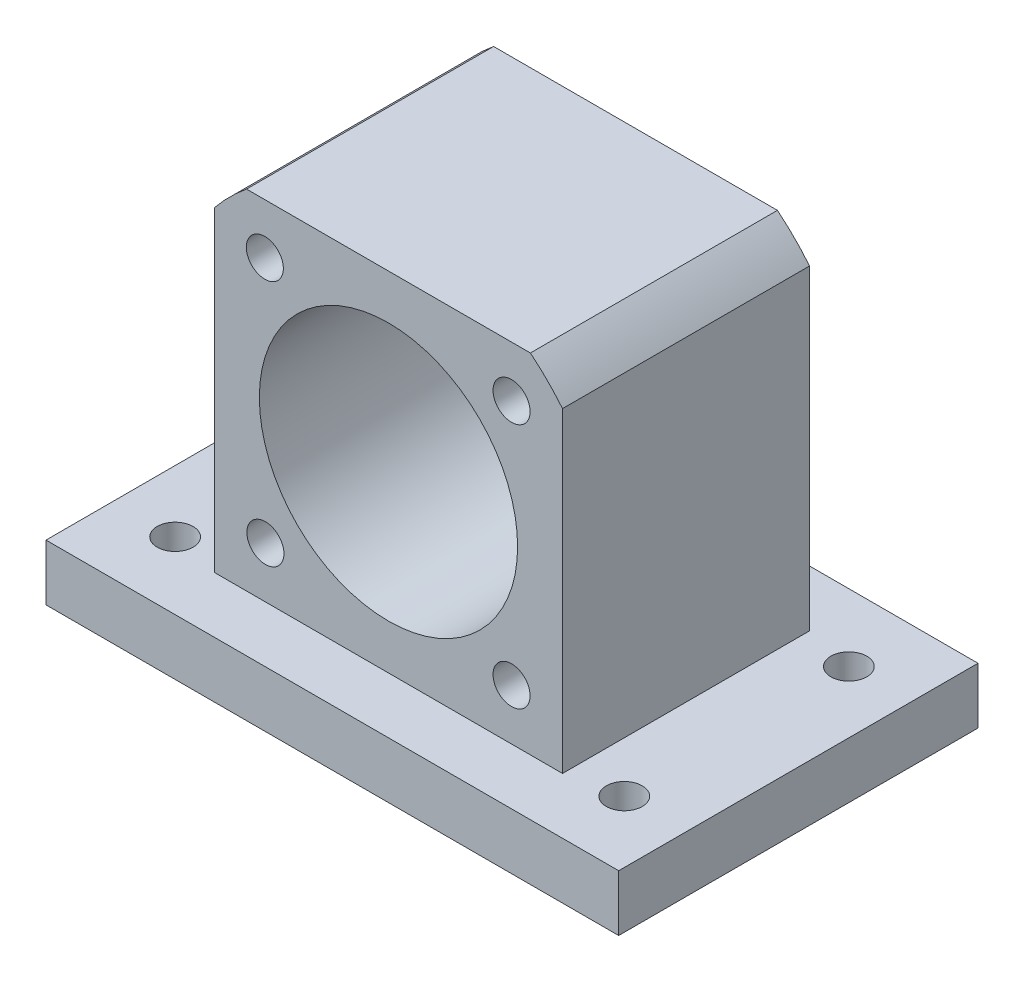
ISO-10303-21;
HEADER;
FILE_DESCRIPTION(('STEP AP214'),'2;1');
FILE_NAME('part.step','',(''),(''),'','','');
FILE_SCHEMA(('AUTOMOTIVE_DESIGN { 1 0 10303 214 1 1 1 1 }'));
ENDSEC;
DATA;
#1=APPLICATION_CONTEXT('core data for automotive mechanical design processes');
#2=APPLICATION_PROTOCOL_DEFINITION('international standard','automotive_design',2000,#1);
#3=PRODUCT_CONTEXT('',#1,'mechanical');
#4=PRODUCT('Part','Part','',(#3));
#5=PRODUCT_RELATED_PRODUCT_CATEGORY('part','',(#4));
#6=PRODUCT_DEFINITION_FORMATION('','',#4);
#7=PRODUCT_DEFINITION_CONTEXT('part definition',#1,'design');
#8=PRODUCT_DEFINITION('design','',#6,#7);
#9=PRODUCT_DEFINITION_SHAPE('','',#8);
#10=(LENGTH_UNIT() NAMED_UNIT(*) SI_UNIT(.MILLI.,.METRE.));
#11=(NAMED_UNIT(*) PLANE_ANGLE_UNIT() SI_UNIT($,.RADIAN.));
#12=(NAMED_UNIT(*) SI_UNIT($,.STERADIAN.) SOLID_ANGLE_UNIT());
#13=UNCERTAINTY_MEASURE_WITH_UNIT(LENGTH_MEASURE(1.E-05),#10,'distance_accuracy_value','');
#14=(GEOMETRIC_REPRESENTATION_CONTEXT(3) GLOBAL_UNCERTAINTY_ASSIGNED_CONTEXT((#13)) GLOBAL_UNIT_ASSIGNED_CONTEXT((#10,
#11,#12)) REPRESENTATION_CONTEXT('',''));
#15=CARTESIAN_POINT('',(0.,0.,0.));
#16=DIRECTION('',(0.,0.,1.));
#17=DIRECTION('',(1.,0.,0.));
#18=AXIS2_PLACEMENT_3D('',#15,#16,#17);
#19=CARTESIAN_POINT('',(15.5,-15.5,11.));
#20=DIRECTION('',(-1.,0.,0.));
#21=DIRECTION('',(0.,0.,1.));
#22=AXIS2_PLACEMENT_3D('',#19,#20,#21);
#23=PLANE('',#22);
#24=DIRECTION('',(0.,1.,0.));
#25=VECTOR('',#24,1.);
#26=CARTESIAN_POINT('',(15.5,-15.5,-11.));
#27=LINE('',#26,#25);
#28=CARTESIAN_POINT('',(15.5,-15.5,-11.));
#29=VERTEX_POINT('',#28);
#30=CARTESIAN_POINT('',(15.5,12.6392246597645,-11.));
#31=VERTEX_POINT('',#30);
#32=EDGE_CURVE('E118',#29,#31,#27,.T.);
#33=ORIENTED_EDGE('',*,*,#32,.T.);
#34=DIRECTION('',(0.,0.,-1.));
#35=VECTOR('',#34,1.);
#36=CARTESIAN_POINT('',(15.5,12.6392246597645,11.));
#37=LINE('',#36,#35);
#38=CARTESIAN_POINT('',(15.5,12.6392246597645,11.));
#39=VERTEX_POINT('',#38);
#40=EDGE_CURVE('E11',#39,#31,#37,.T.);
#41=ORIENTED_EDGE('',*,*,#40,.F.);
#42=DIRECTION('',(0.,1.,0.));
#43=VECTOR('',#42,1.);
#44=CARTESIAN_POINT('',(15.5,-15.5,11.));
#45=LINE('',#44,#43);
#46=CARTESIAN_POINT('',(15.5,-15.5,11.));
#47=VERTEX_POINT('',#46);
#48=EDGE_CURVE('E131',#47,#39,#45,.T.);
#49=ORIENTED_EDGE('',*,*,#48,.F.);
#50=DIRECTION('',(0.,0.,-1.));
#51=VECTOR('',#50,1.);
#52=CARTESIAN_POINT('',(15.5,-15.5,11.));
#53=LINE('',#52,#51);
#54=EDGE_CURVE('E78',#47,#29,#53,.T.);
#55=ORIENTED_EDGE('',*,*,#54,.T.);
#56=EDGE_LOOP('',(#33,#41,#49,#55));
#57=FACE_BOUND('',#56,.T.);
#58=ADVANCED_FACE('F34',(#57),#23,.F.);
#59=CARTESIAN_POINT('',(0.,0.,11.));
#60=DIRECTION('',(0.,0.,-1.));
#61=DIRECTION('',(-1.,0.,0.));
#62=AXIS2_PLACEMENT_3D('',#59,#60,#61);
#63=CYLINDRICAL_SURFACE('',#62,20.);
#64=CARTESIAN_POINT('',(0.,0.,-11.));
#65=DIRECTION('',(0.,0.,1.));
#66=DIRECTION('',(1.,0.,0.));
#67=AXIS2_PLACEMENT_3D('',#64,#65,#66);
#68=CIRCLE('',#67,20.);
#69=CARTESIAN_POINT('',(12.6392246597645,15.5,-11.));
#70=VERTEX_POINT('',#69);
#71=EDGE_CURVE('E120',#31,#70,#68,.T.);
#72=ORIENTED_EDGE('',*,*,#71,.T.);
#73=DIRECTION('',(0.,0.,-1.));
#74=VECTOR('',#73,1.);
#75=CARTESIAN_POINT('',(12.6392246597645,15.5,11.));
#76=LINE('',#75,#74);
#77=CARTESIAN_POINT('',(12.6392246597645,15.5,11.));
#78=VERTEX_POINT('',#77);
#79=EDGE_CURVE('E42',#78,#70,#76,.T.);
#80=ORIENTED_EDGE('',*,*,#79,.F.);
#81=CARTESIAN_POINT('',(0.,0.,11.));
#82=DIRECTION('',(0.,0.,1.));
#83=DIRECTION('',(1.,0.,0.));
#84=AXIS2_PLACEMENT_3D('',#81,#82,#83);
#85=CIRCLE('',#84,20.);
#86=EDGE_CURVE('E86',#39,#78,#85,.T.);
#87=ORIENTED_EDGE('',*,*,#86,.F.);
#88=ORIENTED_EDGE('',*,*,#40,.T.);
#89=EDGE_LOOP('',(#72,#80,#87,#88));
#90=FACE_BOUND('',#89,.T.);
#91=ADVANCED_FACE('F167',(#90),#63,.T.);
#92=CARTESIAN_POINT('',(12.6392246597645,15.5,11.));
#93=DIRECTION('',(0.,-1.,0.));
#94=DIRECTION('',(1.,0.,0.));
#95=AXIS2_PLACEMENT_3D('',#92,#93,#94);
#96=PLANE('',#95);
#97=DIRECTION('',(-1.,0.,0.));
#98=VECTOR('',#97,1.);
#99=CARTESIAN_POINT('',(12.6392246597645,15.5,-11.));
#100=LINE('',#99,#98);
#101=CARTESIAN_POINT('',(-12.6392246597645,15.5,-11.));
#102=VERTEX_POINT('',#101);
#103=EDGE_CURVE('E123',#70,#102,#100,.T.);
#104=ORIENTED_EDGE('',*,*,#103,.T.);
#105=DIRECTION('',(0.,0.,-1.));
#106=VECTOR('',#105,1.);
#107=CARTESIAN_POINT('',(-12.6392246597645,15.5,11.));
#108=LINE('',#107,#106);
#109=CARTESIAN_POINT('',(-12.6392246597645,15.5,11.));
#110=VERTEX_POINT('',#109);
#111=EDGE_CURVE('E109',#110,#102,#108,.T.);
#112=ORIENTED_EDGE('',*,*,#111,.F.);
#113=DIRECTION('',(-1.,0.,0.));
#114=VECTOR('',#113,1.);
#115=CARTESIAN_POINT('',(12.6392246597645,15.5,11.));
#116=LINE('',#115,#114);
#117=EDGE_CURVE('E101',#78,#110,#116,.T.);
#118=ORIENTED_EDGE('',*,*,#117,.F.);
#119=ORIENTED_EDGE('',*,*,#79,.T.);
#120=EDGE_LOOP('',(#104,#112,#118,#119));
#121=FACE_BOUND('',#120,.T.);
#122=ADVANCED_FACE('F137',(#121),#96,.F.);
#123=CARTESIAN_POINT('',(0.,0.,11.));
#124=DIRECTION('',(0.,0.,-1.));
#125=DIRECTION('',(-1.,0.,0.));
#126=AXIS2_PLACEMENT_3D('',#123,#124,#125);
#127=CYLINDRICAL_SURFACE('',#126,20.);
#128=CARTESIAN_POINT('',(0.,0.,-11.));
#129=DIRECTION('',(0.,0.,1.));
#130=DIRECTION('',(1.,0.,0.));
#131=AXIS2_PLACEMENT_3D('',#128,#129,#130);
#132=CIRCLE('',#131,20.);
#133=CARTESIAN_POINT('',(-15.5,12.6392246597645,-11.));
#134=VERTEX_POINT('',#133);
#135=EDGE_CURVE('E71',#102,#134,#132,.T.);
#136=ORIENTED_EDGE('',*,*,#135,.T.);
#137=DIRECTION('',(0.,0.,-1.));
#138=VECTOR('',#137,1.);
#139=CARTESIAN_POINT('',(-15.5,12.6392246597645,11.));
#140=LINE('',#139,#138);
#141=CARTESIAN_POINT('',(-15.5,12.6392246597645,11.));
#142=VERTEX_POINT('',#141);
#143=EDGE_CURVE('E104',#142,#134,#140,.T.);
#144=ORIENTED_EDGE('',*,*,#143,.F.);
#145=CARTESIAN_POINT('',(0.,0.,11.));
#146=DIRECTION('',(0.,0.,1.));
#147=DIRECTION('',(1.,0.,0.));
#148=AXIS2_PLACEMENT_3D('',#145,#146,#147);
#149=CIRCLE('',#148,20.);
#150=EDGE_CURVE('E95',#110,#142,#149,.T.);
#151=ORIENTED_EDGE('',*,*,#150,.F.);
#152=ORIENTED_EDGE('',*,*,#111,.T.);
#153=EDGE_LOOP('',(#136,#144,#151,#152));
#154=FACE_BOUND('',#153,.T.);
#155=ADVANCED_FACE('F105',(#154),#127,.T.);
#156=CARTESIAN_POINT('',(-15.5,-15.5,11.));
#157=DIRECTION('',(1.,0.,0.));
#158=DIRECTION('',(0.,0.,-1.));
#159=AXIS2_PLACEMENT_3D('',#156,#157,#158);
#160=PLANE('',#159);
#161=DIRECTION('',(0.,-1.,0.));
#162=VECTOR('',#161,1.);
#163=CARTESIAN_POINT('',(-15.5,-15.5,-11.));
#164=LINE('',#163,#162);
#165=CARTESIAN_POINT('',(-15.5,-15.5,-11.));
#166=VERTEX_POINT('',#165);
#167=EDGE_CURVE('E126',#134,#166,#164,.T.);
#168=ORIENTED_EDGE('',*,*,#167,.T.);
#169=DIRECTION('',(0.,0.,-1.));
#170=VECTOR('',#169,1.);
#171=CARTESIAN_POINT('',(-15.5,-15.5,11.));
#172=LINE('',#171,#170);
#173=CARTESIAN_POINT('',(-15.5,-15.5,11.));
#174=VERTEX_POINT('',#173);
#175=EDGE_CURVE('E110',#174,#166,#172,.T.);
#176=ORIENTED_EDGE('',*,*,#175,.F.);
#177=DIRECTION('',(0.,-1.,0.));
#178=VECTOR('',#177,1.);
#179=CARTESIAN_POINT('',(-15.5,-15.5,11.));
#180=LINE('',#179,#178);
#181=EDGE_CURVE('E98',#142,#174,#180,.T.);
#182=ORIENTED_EDGE('',*,*,#181,.F.);
#183=ORIENTED_EDGE('',*,*,#143,.T.);
#184=EDGE_LOOP('',(#168,#176,#182,#183));
#185=FACE_BOUND('',#184,.T.);
#186=ADVANCED_FACE('F112',(#185),#160,.F.);
#187=CARTESIAN_POINT('',(0.,0.,11.));
#188=DIRECTION('',(0.,0.,1.));
#189=DIRECTION('',(1.,0.,0.));
#190=AXIS2_PLACEMENT_3D('',#187,#188,#189);
#191=PLANE('',#190);
#192=CARTESIAN_POINT('',(-11.012100521647,11.0121005216467,11.));
#193=DIRECTION('',(0.,0.,1.));
#194=DIRECTION('',(1.,0.,0.));
#195=AXIS2_PLACEMENT_3D('',#192,#193,#194);
#196=CIRCLE('',#195,1.64999999999999);
#197=CARTESIAN_POINT('',(-9.36210052164702,11.0121005216467,11.));
#198=VERTEX_POINT('',#197);
#199=EDGE_CURVE('E201',#198,#198,#196,.T.);
#200=ORIENTED_EDGE('',*,*,#199,.F.);
#201=EDGE_LOOP('',(#200));
#202=FACE_BOUND('',#201,.T.);
#203=CARTESIAN_POINT('',(10.9601551083914,10.9601551083915,11.));
#204=DIRECTION('',(0.,0.,1.));
#205=DIRECTION('',(1.,0.,0.));
#206=AXIS2_PLACEMENT_3D('',#203,#204,#205);
#207=CIRCLE('',#206,1.64999999999999);
#208=CARTESIAN_POINT('',(12.6101551083914,10.9601551083915,11.));
#209=VERTEX_POINT('',#208);
#210=EDGE_CURVE('E195',#209,#209,#207,.T.);
#211=ORIENTED_EDGE('',*,*,#210,.F.);
#212=EDGE_LOOP('',(#211));
#213=FACE_BOUND('',#212,.T.);
#214=CARTESIAN_POINT('',(10.9601551083915,-10.9601551083915,11.));
#215=DIRECTION('',(0.,0.,1.));
#216=DIRECTION('',(1.,0.,0.));
#217=AXIS2_PLACEMENT_3D('',#214,#215,#216);
#218=CIRCLE('',#217,1.64999999999999);
#219=CARTESIAN_POINT('',(12.6101551083915,-10.9601551083915,11.));
#220=VERTEX_POINT('',#219);
#221=EDGE_CURVE('E189',#220,#220,#218,.T.);
#222=ORIENTED_EDGE('',*,*,#221,.F.);
#223=EDGE_LOOP('',(#222));
#224=FACE_BOUND('',#223,.T.);
#225=CARTESIAN_POINT('',(-10.9601551083915,-10.9601551083915,11.));
#226=DIRECTION('',(0.,0.,1.));
#227=DIRECTION('',(1.,0.,0.));
#228=AXIS2_PLACEMENT_3D('',#225,#226,#227);
#229=CIRCLE('',#228,1.64999999999999);
#230=CARTESIAN_POINT('',(-9.31015510839149,-10.9601551083915,11.));
#231=VERTEX_POINT('',#230);
#232=EDGE_CURVE('E183',#231,#231,#229,.T.);
#233=ORIENTED_EDGE('',*,*,#232,.F.);
#234=EDGE_LOOP('',(#233));
#235=FACE_BOUND('',#234,.T.);
#236=CARTESIAN_POINT('',(0.,0.,11.));
#237=DIRECTION('',(0.,0.,1.));
#238=DIRECTION('',(1.,0.,0.));
#239=AXIS2_PLACEMENT_3D('',#236,#237,#238);
#240=CIRCLE('',#239,11.5);
#241=CARTESIAN_POINT('',(11.5,0.,11.));
#242=VERTEX_POINT('',#241);
#243=EDGE_CURVE('E177',#242,#242,#240,.T.);
#244=ORIENTED_EDGE('',*,*,#243,.F.);
#245=EDGE_LOOP('',(#244));
#246=FACE_BOUND('',#245,.T.);
#247=ORIENTED_EDGE('',*,*,#48,.T.);
#248=ORIENTED_EDGE('',*,*,#86,.T.);
#249=ORIENTED_EDGE('',*,*,#117,.T.);
#250=ORIENTED_EDGE('',*,*,#150,.T.);
#251=ORIENTED_EDGE('',*,*,#181,.T.);
#252=DIRECTION('',(1.,0.,0.));
#253=VECTOR('',#252,1.);
#254=CARTESIAN_POINT('',(15.5,-15.5,11.));
#255=LINE('',#254,#253);
#256=EDGE_CURVE('E50',#174,#47,#255,.T.);
#257=ORIENTED_EDGE('',*,*,#256,.T.);
#258=EDGE_LOOP('',(#247,#248,#249,#250,#251,#257));
#259=FACE_BOUND('',#258,.T.);
#260=ADVANCED_FACE('F96',(#202,#213,#224,#235,#246,#259),#191,.T.);
#261=CARTESIAN_POINT('',(0.,0.,-11.));
#262=DIRECTION('',(0.,0.,1.));
#263=DIRECTION('',(1.,0.,0.));
#264=AXIS2_PLACEMENT_3D('',#261,#262,#263);
#265=PLANE('',#264);
#266=CARTESIAN_POINT('',(0.,0.,-11.));
#267=DIRECTION('',(0.,0.,1.));
#268=DIRECTION('',(1.,0.,0.));
#269=AXIS2_PLACEMENT_3D('',#266,#267,#268);
#270=CIRCLE('',#269,11.5);
#271=CARTESIAN_POINT('',(11.5,0.,-11.));
#272=VERTEX_POINT('',#271);
#273=EDGE_CURVE('E121',#272,#272,#270,.F.);
#274=ORIENTED_EDGE('',*,*,#273,.F.);
#275=EDGE_LOOP('',(#274));
#276=FACE_BOUND('',#275,.T.);
#277=ORIENTED_EDGE('',*,*,#32,.F.);
#278=DIRECTION('',(1.,0.,0.));
#279=VECTOR('',#278,1.);
#280=CARTESIAN_POINT('',(15.5,-15.5,-11.));
#281=LINE('',#280,#279);
#282=EDGE_CURVE('E128',#166,#29,#281,.T.);
#283=ORIENTED_EDGE('',*,*,#282,.F.);
#284=ORIENTED_EDGE('',*,*,#167,.F.);
#285=ORIENTED_EDGE('',*,*,#135,.F.);
#286=ORIENTED_EDGE('',*,*,#103,.F.);
#287=ORIENTED_EDGE('',*,*,#71,.F.);
#288=EDGE_LOOP('',(#277,#283,#284,#285,#286,#287));
#289=FACE_BOUND('',#288,.T.);
#290=ADVANCED_FACE('F139',(#276,#289),#265,.F.);
#291=CARTESIAN_POINT('',(0.,0.,-11.001));
#292=DIRECTION('',(0.,0.,1.));
#293=DIRECTION('',(1.,0.,0.));
#294=AXIS2_PLACEMENT_3D('',#291,#292,#293);
#295=CYLINDRICAL_SURFACE('',#294,11.5);
#296=ORIENTED_EDGE('',*,*,#243,.T.);
#297=EDGE_LOOP('',(#296));
#298=FACE_BOUND('',#297,.T.);
#299=ORIENTED_EDGE('',*,*,#273,.T.);
#300=EDGE_LOOP('',(#299));
#301=FACE_BOUND('',#300,.T.);
#302=ADVANCED_FACE('F315',(#298,#301),#295,.F.);
#303=CARTESIAN_POINT('',(-10.9601551083915,-10.9601551083915,0.900000000000001));
#304=DIRECTION('',(0.,0.,1.));
#305=DIRECTION('',(1.,0.,0.));
#306=AXIS2_PLACEMENT_3D('',#303,#304,#305);
#307=CONICAL_SURFACE('',#306,1.64999999999999,1.02974425867665);
#308=CARTESIAN_POINT('',(-10.9601551083915,-10.9601551083915,-0.0914200213954757));
#309=VERTEX_POINT('',#308);
#310=VERTEX_LOOP('',#309);
#311=FACE_BOUND('',#310,.T.);
#312=CARTESIAN_POINT('',(-10.9601551083915,-10.9601551083915,0.900000000000001));
#313=DIRECTION('',(0.,0.,1.));
#314=DIRECTION('',(1.,0.,0.));
#315=AXIS2_PLACEMENT_3D('',#312,#313,#314);
#316=CIRCLE('',#315,1.64999999999999);
#317=CARTESIAN_POINT('',(-9.3101551083915,-10.9601551083915,0.900000000000001));
#318=VERTEX_POINT('',#317);
#319=EDGE_CURVE('E180',#318,#318,#316,.T.);
#320=ORIENTED_EDGE('',*,*,#319,.T.);
#321=EDGE_LOOP('',(#320));
#322=FACE_BOUND('',#321,.T.);
#323=ADVANCED_FACE('F311',(#311,#322),#307,.F.);
#324=CARTESIAN_POINT('',(-10.9601551083915,-10.9601551083915,11.));
#325=DIRECTION('',(0.,0.,1.));
#326=DIRECTION('',(1.,0.,0.));
#327=AXIS2_PLACEMENT_3D('',#324,#325,#326);
#328=CYLINDRICAL_SURFACE('',#327,1.64999999999999);
#329=ORIENTED_EDGE('',*,*,#319,.F.);
#330=EDGE_LOOP('',(#329));
#331=FACE_BOUND('',#330,.T.);
#332=ORIENTED_EDGE('',*,*,#232,.T.);
#333=EDGE_LOOP('',(#332));
#334=FACE_BOUND('',#333,.T.);
#335=ADVANCED_FACE('F314',(#331,#334),#328,.F.);
#336=CARTESIAN_POINT('',(10.9601551083915,-10.9601551083915,0.900000000000001));
#337=DIRECTION('',(0.,0.,1.));
#338=DIRECTION('',(1.,0.,0.));
#339=AXIS2_PLACEMENT_3D('',#336,#337,#338);
#340=CONICAL_SURFACE('',#339,1.64999999999999,1.02974425867665);
#341=CARTESIAN_POINT('',(10.9601551083915,-10.9601551083915,-0.0914200213954757));
#342=VERTEX_POINT('',#341);
#343=VERTEX_LOOP('',#342);
#344=FACE_BOUND('',#343,.T.);
#345=CARTESIAN_POINT('',(10.9601551083915,-10.9601551083915,0.900000000000001));
#346=DIRECTION('',(0.,0.,1.));
#347=DIRECTION('',(1.,0.,0.));
#348=AXIS2_PLACEMENT_3D('',#345,#346,#347);
#349=CIRCLE('',#348,1.64999999999999);
#350=CARTESIAN_POINT('',(12.6101551083914,-10.9601551083915,0.900000000000001));
#351=VERTEX_POINT('',#350);
#352=EDGE_CURVE('E186',#351,#351,#349,.T.);
#353=ORIENTED_EDGE('',*,*,#352,.T.);
#354=EDGE_LOOP('',(#353));
#355=FACE_BOUND('',#354,.T.);
#356=ADVANCED_FACE('F321',(#344,#355),#340,.F.);
#357=CARTESIAN_POINT('',(10.9601551083915,-10.9601551083915,11.));
#358=DIRECTION('',(0.,0.,1.));
#359=DIRECTION('',(1.,0.,0.));
#360=AXIS2_PLACEMENT_3D('',#357,#358,#359);
#361=CYLINDRICAL_SURFACE('',#360,1.64999999999999);
#362=ORIENTED_EDGE('',*,*,#352,.F.);
#363=EDGE_LOOP('',(#362));
#364=FACE_BOUND('',#363,.T.);
#365=ORIENTED_EDGE('',*,*,#221,.T.);
#366=EDGE_LOOP('',(#365));
#367=FACE_BOUND('',#366,.T.);
#368=ADVANCED_FACE('F495',(#364,#367),#361,.F.);
#369=CARTESIAN_POINT('',(10.9601551083914,10.9601551083915,0.900000000000001));
#370=DIRECTION('',(0.,0.,1.));
#371=DIRECTION('',(1.,0.,0.));
#372=AXIS2_PLACEMENT_3D('',#369,#370,#371);
#373=CONICAL_SURFACE('',#372,1.64999999999999,1.02974425867665);
#374=CARTESIAN_POINT('',(10.9601551083914,10.9601551083915,-0.0914200213954757));
#375=VERTEX_POINT('',#374);
#376=VERTEX_LOOP('',#375);
#377=FACE_BOUND('',#376,.T.);
#378=CARTESIAN_POINT('',(10.9601551083914,10.9601551083915,0.900000000000001));
#379=DIRECTION('',(0.,0.,1.));
#380=DIRECTION('',(1.,0.,0.));
#381=AXIS2_PLACEMENT_3D('',#378,#379,#380);
#382=CIRCLE('',#381,1.64999999999999);
#383=CARTESIAN_POINT('',(12.6101551083914,10.9601551083915,0.900000000000001));
#384=VERTEX_POINT('',#383);
#385=EDGE_CURVE('E192',#384,#384,#382,.T.);
#386=ORIENTED_EDGE('',*,*,#385,.T.);
#387=EDGE_LOOP('',(#386));
#388=FACE_BOUND('',#387,.T.);
#389=ADVANCED_FACE('F486',(#377,#388),#373,.F.);
#390=CARTESIAN_POINT('',(10.9601551083914,10.9601551083915,11.));
#391=DIRECTION('',(0.,0.,1.));
#392=DIRECTION('',(1.,0.,0.));
#393=AXIS2_PLACEMENT_3D('',#390,#391,#392);
#394=CYLINDRICAL_SURFACE('',#393,1.64999999999999);
#395=ORIENTED_EDGE('',*,*,#385,.F.);
#396=EDGE_LOOP('',(#395));
#397=FACE_BOUND('',#396,.T.);
#398=ORIENTED_EDGE('',*,*,#210,.T.);
#399=EDGE_LOOP('',(#398));
#400=FACE_BOUND('',#399,.T.);
#401=ADVANCED_FACE('F477',(#397,#400),#394,.F.);
#402=CARTESIAN_POINT('',(-11.012100521647,11.0121005216467,0.900000000000001));
#403=DIRECTION('',(0.,0.,1.));
#404=DIRECTION('',(1.,0.,0.));
#405=AXIS2_PLACEMENT_3D('',#402,#403,#404);
#406=CONICAL_SURFACE('',#405,1.64999999999999,1.02974425867665);
#407=CARTESIAN_POINT('',(-11.012100521647,11.0121005216467,-0.0914200213954757));
#408=VERTEX_POINT('',#407);
#409=VERTEX_LOOP('',#408);
#410=FACE_BOUND('',#409,.T.);
#411=CARTESIAN_POINT('',(-11.012100521647,11.0121005216467,0.900000000000001));
#412=DIRECTION('',(0.,0.,1.));
#413=DIRECTION('',(1.,0.,0.));
#414=AXIS2_PLACEMENT_3D('',#411,#412,#413);
#415=CIRCLE('',#414,1.64999999999999);
#416=CARTESIAN_POINT('',(-9.36210052164703,11.0121005216467,0.900000000000001));
#417=VERTEX_POINT('',#416);
#418=EDGE_CURVE('E198',#417,#417,#415,.T.);
#419=ORIENTED_EDGE('',*,*,#418,.T.);
#420=EDGE_LOOP('',(#419));
#421=FACE_BOUND('',#420,.T.);
#422=ADVANCED_FACE('F159',(#410,#421),#406,.F.);
#423=CARTESIAN_POINT('',(-11.012100521647,11.0121005216467,11.));
#424=DIRECTION('',(0.,0.,1.));
#425=DIRECTION('',(1.,0.,0.));
#426=AXIS2_PLACEMENT_3D('',#423,#424,#425);
#427=CYLINDRICAL_SURFACE('',#426,1.64999999999999);
#428=ORIENTED_EDGE('',*,*,#418,.F.);
#429=EDGE_LOOP('',(#428));
#430=FACE_BOUND('',#429,.T.);
#431=ORIENTED_EDGE('',*,*,#199,.T.);
#432=EDGE_LOOP('',(#431));
#433=FACE_BOUND('',#432,.T.);
#434=ADVANCED_FACE('F149',(#430,#433),#427,.F.);
#435=CARTESIAN_POINT('',(0.,-15.5,0.));
#436=DIRECTION('',(0.,-1.,0.));
#437=DIRECTION('',(0.,0.,-1.));
#438=AXIS2_PLACEMENT_3D('',#435,#436,#437);
#439=PLANE('',#438);
#440=CARTESIAN_POINT('',(-20.,-15.5,10.));
#441=DIRECTION('',(0.,-1.,0.));
#442=DIRECTION('',(0.,0.,-1.));
#443=AXIS2_PLACEMENT_3D('',#440,#441,#442);
#444=CIRCLE('',#443,1.6);
#445=CARTESIAN_POINT('',(-20.,-15.5,8.4));
#446=VERTEX_POINT('',#445);
#447=EDGE_CURVE('E258',#446,#446,#444,.T.);
#448=ORIENTED_EDGE('',*,*,#447,.T.);
#449=EDGE_LOOP('',(#448));
#450=FACE_BOUND('',#449,.T.);
#451=CARTESIAN_POINT('',(20.,-15.5,9.99999999999999));
#452=DIRECTION('',(0.,-1.,0.));
#453=DIRECTION('',(0.,0.,-1.));
#454=AXIS2_PLACEMENT_3D('',#451,#452,#453);
#455=CIRCLE('',#454,1.6);
#456=CARTESIAN_POINT('',(20.,-15.5,8.39999999999999));
#457=VERTEX_POINT('',#456);
#458=EDGE_CURVE('E252',#457,#457,#455,.T.);
#459=ORIENTED_EDGE('',*,*,#458,.T.);
#460=EDGE_LOOP('',(#459));
#461=FACE_BOUND('',#460,.T.);
#462=CARTESIAN_POINT('',(20.,-15.5,-10.));
#463=DIRECTION('',(0.,-1.,0.));
#464=DIRECTION('',(0.,0.,-1.));
#465=AXIS2_PLACEMENT_3D('',#462,#463,#464);
#466=CIRCLE('',#465,1.6);
#467=CARTESIAN_POINT('',(20.,-15.5,-11.6));
#468=VERTEX_POINT('',#467);
#469=EDGE_CURVE('E246',#468,#468,#466,.T.);
#470=ORIENTED_EDGE('',*,*,#469,.T.);
#471=EDGE_LOOP('',(#470));
#472=FACE_BOUND('',#471,.T.);
#473=CARTESIAN_POINT('',(-20.,-15.5,-10.));
#474=DIRECTION('',(0.,-1.,0.));
#475=DIRECTION('',(0.,0.,-1.));
#476=AXIS2_PLACEMENT_3D('',#473,#474,#475);
#477=CIRCLE('',#476,1.6);
#478=CARTESIAN_POINT('',(-20.,-15.5,-11.6));
#479=VERTEX_POINT('',#478);
#480=EDGE_CURVE('E230',#479,#479,#477,.T.);
#481=ORIENTED_EDGE('',*,*,#480,.T.);
#482=EDGE_LOOP('',(#481));
#483=FACE_BOUND('',#482,.T.);
#484=DIRECTION('',(0.,0.,-1.));
#485=VECTOR('',#484,1.);
#486=CARTESIAN_POINT('',(-25.5,-15.5,-16.));
#487=LINE('',#486,#485);
#488=CARTESIAN_POINT('',(-25.5,-15.5,16.));
#489=VERTEX_POINT('',#488);
#490=CARTESIAN_POINT('',(-25.5,-15.5,-16.));
#491=VERTEX_POINT('',#490);
#492=EDGE_CURVE('E227',#489,#491,#487,.T.);
#493=ORIENTED_EDGE('',*,*,#492,.F.);
#494=DIRECTION('',(-1.,0.,0.));
#495=VECTOR('',#494,1.);
#496=CARTESIAN_POINT('',(25.5,-15.5,16.));
#497=LINE('',#496,#495);
#498=CARTESIAN_POINT('',(25.5,-15.5,16.));
#499=VERTEX_POINT('',#498);
#500=EDGE_CURVE('E217',#499,#489,#497,.T.);
#501=ORIENTED_EDGE('',*,*,#500,.F.);
#502=DIRECTION('',(0.,0.,1.));
#503=VECTOR('',#502,1.);
#504=CARTESIAN_POINT('',(25.5,-15.5,-16.));
#505=LINE('',#504,#503);
#506=CARTESIAN_POINT('',(25.5,-15.5,-16.));
#507=VERTEX_POINT('',#506);
#508=EDGE_CURVE('E221',#507,#499,#505,.T.);
#509=ORIENTED_EDGE('',*,*,#508,.F.);
#510=DIRECTION('',(1.,0.,0.));
#511=VECTOR('',#510,1.);
#512=CARTESIAN_POINT('',(25.5,-15.5,-16.));
#513=LINE('',#512,#511);
#514=EDGE_CURVE('E224',#491,#507,#513,.T.);
#515=ORIENTED_EDGE('',*,*,#514,.F.);
#516=EDGE_LOOP('',(#493,#501,#509,#515));
#517=FACE_BOUND('',#516,.T.);
#518=ORIENTED_EDGE('',*,*,#175,.T.);
#519=ORIENTED_EDGE('',*,*,#282,.T.);
#520=ORIENTED_EDGE('',*,*,#54,.F.);
#521=ORIENTED_EDGE('',*,*,#256,.F.);
#522=EDGE_LOOP('',(#518,#519,#520,#521));
#523=FACE_BOUND('',#522,.T.);
#524=ADVANCED_FACE('F146',(#450,#461,#472,#483,#517,#523),#439,.F.);
#525=CARTESIAN_POINT('',(-25.5,-20.5,-16.));
#526=DIRECTION('',(1.,0.,0.));
#527=DIRECTION('',(0.,0.,-1.));
#528=AXIS2_PLACEMENT_3D('',#525,#526,#527);
#529=PLANE('',#528);
#530=ORIENTED_EDGE('',*,*,#492,.T.);
#531=DIRECTION('',(0.,1.,0.));
#532=VECTOR('',#531,1.);
#533=CARTESIAN_POINT('',(-25.5,-20.5,-16.));
#534=LINE('',#533,#532);
#535=CARTESIAN_POINT('',(-25.5,-20.5,-16.));
#536=VERTEX_POINT('',#535);
#537=EDGE_CURVE('E204',#536,#491,#534,.T.);
#538=ORIENTED_EDGE('',*,*,#537,.F.);
#539=DIRECTION('',(0.,0.,-1.));
#540=VECTOR('',#539,1.);
#541=CARTESIAN_POINT('',(-25.5,-20.5,-16.));
#542=LINE('',#541,#540);
#543=CARTESIAN_POINT('',(-25.5,-20.5,16.));
#544=VERTEX_POINT('',#543);
#545=EDGE_CURVE('E220',#544,#536,#542,.T.);
#546=ORIENTED_EDGE('',*,*,#545,.F.);
#547=DIRECTION('',(0.,1.,0.));
#548=VECTOR('',#547,1.);
#549=CARTESIAN_POINT('',(-25.5,-20.5,16.));
#550=LINE('',#549,#548);
#551=EDGE_CURVE('E213',#544,#489,#550,.T.);
#552=ORIENTED_EDGE('',*,*,#551,.T.);
#553=EDGE_LOOP('',(#530,#538,#546,#552));
#554=FACE_BOUND('',#553,.T.);
#555=ADVANCED_FACE('F148',(#554),#529,.F.);
#556=CARTESIAN_POINT('',(25.5,-20.5,-16.));
#557=DIRECTION('',(0.,0.,1.));
#558=DIRECTION('',(1.,0.,0.));
#559=AXIS2_PLACEMENT_3D('',#556,#557,#558);
#560=PLANE('',#559);
#561=ORIENTED_EDGE('',*,*,#514,.T.);
#562=DIRECTION('',(0.,1.,0.));
#563=VECTOR('',#562,1.);
#564=CARTESIAN_POINT('',(25.5,-20.5,-16.));
#565=LINE('',#564,#563);
#566=CARTESIAN_POINT('',(25.5,-20.5,-16.));
#567=VERTEX_POINT('',#566);
#568=EDGE_CURVE('E207',#567,#507,#565,.T.);
#569=ORIENTED_EDGE('',*,*,#568,.F.);
#570=DIRECTION('',(1.,0.,0.));
#571=VECTOR('',#570,1.);
#572=CARTESIAN_POINT('',(25.5,-20.5,-16.));
#573=LINE('',#572,#571);
#574=EDGE_CURVE('E236',#536,#567,#573,.T.);
#575=ORIENTED_EDGE('',*,*,#574,.F.);
#576=ORIENTED_EDGE('',*,*,#537,.T.);
#577=EDGE_LOOP('',(#561,#569,#575,#576));
#578=FACE_BOUND('',#577,.T.);
#579=ADVANCED_FACE('F156',(#578),#560,.F.);
#580=CARTESIAN_POINT('',(25.5,-20.5,-16.));
#581=DIRECTION('',(-1.,0.,0.));
#582=DIRECTION('',(0.,0.,1.));
#583=AXIS2_PLACEMENT_3D('',#580,#581,#582);
#584=PLANE('',#583);
#585=ORIENTED_EDGE('',*,*,#508,.T.);
#586=DIRECTION('',(0.,1.,0.));
#587=VECTOR('',#586,1.);
#588=CARTESIAN_POINT('',(25.5,-20.5,16.));
#589=LINE('',#588,#587);
#590=CARTESIAN_POINT('',(25.5,-20.5,16.));
#591=VERTEX_POINT('',#590);
#592=EDGE_CURVE('E210',#591,#499,#589,.T.);
#593=ORIENTED_EDGE('',*,*,#592,.F.);
#594=DIRECTION('',(0.,0.,1.));
#595=VECTOR('',#594,1.);
#596=CARTESIAN_POINT('',(25.5,-20.5,-16.));
#597=LINE('',#596,#595);
#598=EDGE_CURVE('E233',#567,#591,#597,.T.);
#599=ORIENTED_EDGE('',*,*,#598,.F.);
#600=ORIENTED_EDGE('',*,*,#568,.T.);
#601=EDGE_LOOP('',(#585,#593,#599,#600));
#602=FACE_BOUND('',#601,.T.);
#603=ADVANCED_FACE('F384',(#602),#584,.F.);
#604=CARTESIAN_POINT('',(25.5,-20.5,16.));
#605=DIRECTION('',(0.,0.,-1.));
#606=DIRECTION('',(-1.,0.,0.));
#607=AXIS2_PLACEMENT_3D('',#604,#605,#606);
#608=PLANE('',#607);
#609=ORIENTED_EDGE('',*,*,#500,.T.);
#610=ORIENTED_EDGE('',*,*,#551,.F.);
#611=DIRECTION('',(-1.,0.,0.));
#612=VECTOR('',#611,1.);
#613=CARTESIAN_POINT('',(25.5,-20.5,16.));
#614=LINE('',#613,#612);
#615=EDGE_CURVE('E216',#591,#544,#614,.T.);
#616=ORIENTED_EDGE('',*,*,#615,.F.);
#617=ORIENTED_EDGE('',*,*,#592,.T.);
#618=EDGE_LOOP('',(#609,#610,#616,#617));
#619=FACE_BOUND('',#618,.T.);
#620=ADVANCED_FACE('F270',(#619),#608,.F.);
#621=CARTESIAN_POINT('',(0.,-20.5,0.));
#622=DIRECTION('',(0.,-1.,0.));
#623=DIRECTION('',(0.,0.,-1.));
#624=AXIS2_PLACEMENT_3D('',#621,#622,#623);
#625=PLANE('',#624);
#626=CARTESIAN_POINT('',(-20.,-20.5,10.));
#627=DIRECTION('',(0.,-1.,0.));
#628=DIRECTION('',(0.,0.,-1.));
#629=AXIS2_PLACEMENT_3D('',#626,#627,#628);
#630=CIRCLE('',#629,1.6);
#631=CARTESIAN_POINT('',(-20.,-20.5,8.4));
#632=VERTEX_POINT('',#631);
#633=EDGE_CURVE('E260',#632,#632,#630,.T.);
#634=ORIENTED_EDGE('',*,*,#633,.F.);
#635=EDGE_LOOP('',(#634));
#636=FACE_BOUND('',#635,.T.);
#637=CARTESIAN_POINT('',(20.,-20.5,9.99999999999999));
#638=DIRECTION('',(0.,-1.,0.));
#639=DIRECTION('',(0.,0.,-1.));
#640=AXIS2_PLACEMENT_3D('',#637,#638,#639);
#641=CIRCLE('',#640,1.6);
#642=CARTESIAN_POINT('',(20.,-20.5,8.39999999999999));
#643=VERTEX_POINT('',#642);
#644=EDGE_CURVE('E255',#643,#643,#641,.T.);
#645=ORIENTED_EDGE('',*,*,#644,.F.);
#646=EDGE_LOOP('',(#645));
#647=FACE_BOUND('',#646,.T.);
#648=CARTESIAN_POINT('',(20.,-20.5,-10.));
#649=DIRECTION('',(0.,-1.,0.));
#650=DIRECTION('',(0.,0.,-1.));
#651=AXIS2_PLACEMENT_3D('',#648,#649,#650);
#652=CIRCLE('',#651,1.6);
#653=CARTESIAN_POINT('',(20.,-20.5,-11.6));
#654=VERTEX_POINT('',#653);
#655=EDGE_CURVE('E249',#654,#654,#652,.T.);
#656=ORIENTED_EDGE('',*,*,#655,.F.);
#657=EDGE_LOOP('',(#656));
#658=FACE_BOUND('',#657,.T.);
#659=CARTESIAN_POINT('',(-20.,-20.5,-10.));
#660=DIRECTION('',(0.,-1.,0.));
#661=DIRECTION('',(0.,0.,-1.));
#662=AXIS2_PLACEMENT_3D('',#659,#660,#661);
#663=CIRCLE('',#662,1.6);
#664=CARTESIAN_POINT('',(-20.,-20.5,-11.6));
#665=VERTEX_POINT('',#664);
#666=EDGE_CURVE('E243',#665,#665,#663,.T.);
#667=ORIENTED_EDGE('',*,*,#666,.F.);
#668=EDGE_LOOP('',(#667));
#669=FACE_BOUND('',#668,.T.);
#670=ORIENTED_EDGE('',*,*,#545,.T.);
#671=ORIENTED_EDGE('',*,*,#574,.T.);
#672=ORIENTED_EDGE('',*,*,#598,.T.);
#673=ORIENTED_EDGE('',*,*,#615,.T.);
#674=EDGE_LOOP('',(#670,#671,#672,#673));
#675=FACE_BOUND('',#674,.T.);
#676=ADVANCED_FACE('F266',(#636,#647,#658,#669,#675),#625,.T.);
#677=CARTESIAN_POINT('',(-20.,-20.5,-10.));
#678=DIRECTION('',(0.,-1.,0.));
#679=DIRECTION('',(0.,0.,-1.));
#680=AXIS2_PLACEMENT_3D('',#677,#678,#679);
#681=CYLINDRICAL_SURFACE('',#680,1.6);
#682=ORIENTED_EDGE('',*,*,#480,.F.);
#683=EDGE_LOOP('',(#682));
#684=FACE_BOUND('',#683,.T.);
#685=ORIENTED_EDGE('',*,*,#666,.T.);
#686=EDGE_LOOP('',(#685));
#687=FACE_BOUND('',#686,.T.);
#688=ADVANCED_FACE('F269',(#684,#687),#681,.F.);
#689=CARTESIAN_POINT('',(20.,-20.5,-10.));
#690=DIRECTION('',(0.,-1.,0.));
#691=DIRECTION('',(0.,0.,-1.));
#692=AXIS2_PLACEMENT_3D('',#689,#690,#691);
#693=CYLINDRICAL_SURFACE('',#692,1.6);
#694=ORIENTED_EDGE('',*,*,#469,.F.);
#695=EDGE_LOOP('',(#694));
#696=FACE_BOUND('',#695,.T.);
#697=ORIENTED_EDGE('',*,*,#655,.T.);
#698=EDGE_LOOP('',(#697));
#699=FACE_BOUND('',#698,.T.);
#700=ADVANCED_FACE('F420',(#696,#699),#693,.F.);
#701=CARTESIAN_POINT('',(20.,-20.5,9.99999999999999));
#702=DIRECTION('',(0.,-1.,0.));
#703=DIRECTION('',(0.,0.,-1.));
#704=AXIS2_PLACEMENT_3D('',#701,#702,#703);
#705=CYLINDRICAL_SURFACE('',#704,1.6);
#706=ORIENTED_EDGE('',*,*,#458,.F.);
#707=EDGE_LOOP('',(#706));
#708=FACE_BOUND('',#707,.T.);
#709=ORIENTED_EDGE('',*,*,#644,.T.);
#710=EDGE_LOOP('',(#709));
#711=FACE_BOUND('',#710,.T.);
#712=ADVANCED_FACE('F430',(#708,#711),#705,.F.);
#713=CARTESIAN_POINT('',(-20.,-20.5,10.));
#714=DIRECTION('',(0.,-1.,0.));
#715=DIRECTION('',(0.,0.,-1.));
#716=AXIS2_PLACEMENT_3D('',#713,#714,#715);
#717=CYLINDRICAL_SURFACE('',#716,1.6);
#718=ORIENTED_EDGE('',*,*,#447,.F.);
#719=EDGE_LOOP('',(#718));
#720=FACE_BOUND('',#719,.T.);
#721=ORIENTED_EDGE('',*,*,#633,.T.);
#722=EDGE_LOOP('',(#721));
#723=FACE_BOUND('',#722,.T.);
#724=ADVANCED_FACE('F264',(#720,#723),#717,.F.);
#725=CLOSED_SHELL('',(#58,#91,#122,#155,#186,#260,#290,#302,#323,#335,#356,#368,#389,#401,#422,
#434,#524,#555,#579,#603,#620,#676,#688,#700,#712,#724));
#726=MANIFOLD_SOLID_BREP('B2',#725);
#727=ADVANCED_BREP_SHAPE_REPRESENTATION('',(#18,#726),#14);
#728=SHAPE_DEFINITION_REPRESENTATION(#9,#727);
ENDSEC;
END-ISO-10303-21;
